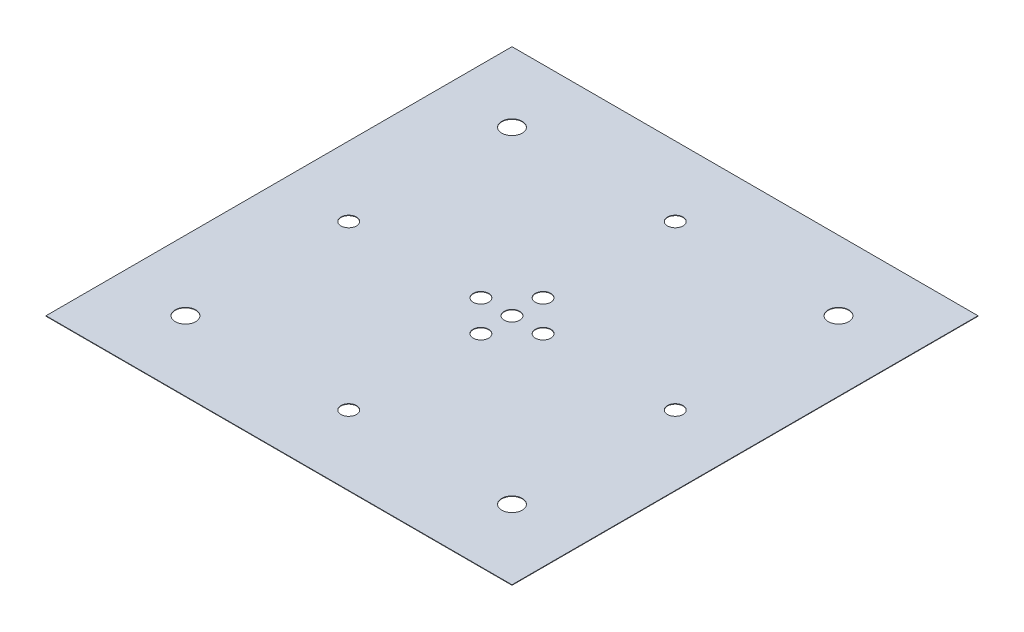
ISO-10303-21;
HEADER;
FILE_DESCRIPTION(('STEP AP214'),'2;1');
FILE_NAME('part.step','',(''),(''),'','','');
FILE_SCHEMA(('AUTOMOTIVE_DESIGN { 1 0 10303 214 1 1 1 1 }'));
ENDSEC;
DATA;
#1=APPLICATION_CONTEXT('core data for automotive mechanical design processes');
#2=APPLICATION_PROTOCOL_DEFINITION('international standard','automotive_design',2000,#1);
#3=PRODUCT_CONTEXT('',#1,'mechanical');
#4=PRODUCT('Part','Part','',(#3));
#5=PRODUCT_RELATED_PRODUCT_CATEGORY('part','',(#4));
#6=PRODUCT_DEFINITION_FORMATION('','',#4);
#7=PRODUCT_DEFINITION_CONTEXT('part definition',#1,'design');
#8=PRODUCT_DEFINITION('design','',#6,#7);
#9=PRODUCT_DEFINITION_SHAPE('','',#8);
#10=(LENGTH_UNIT() NAMED_UNIT(*) SI_UNIT(.MILLI.,.METRE.));
#11=(NAMED_UNIT(*) PLANE_ANGLE_UNIT() SI_UNIT($,.RADIAN.));
#12=(NAMED_UNIT(*) SI_UNIT($,.STERADIAN.) SOLID_ANGLE_UNIT());
#13=UNCERTAINTY_MEASURE_WITH_UNIT(LENGTH_MEASURE(1.E-05),#10,'distance_accuracy_value','');
#14=(GEOMETRIC_REPRESENTATION_CONTEXT(3) GLOBAL_UNCERTAINTY_ASSIGNED_CONTEXT((#13)) GLOBAL_UNIT_ASSIGNED_CONTEXT((#10,
#11,#12)) REPRESENTATION_CONTEXT('',''));
#15=CARTESIAN_POINT('',(0.,0.,0.));
#16=DIRECTION('',(0.,0.,1.));
#17=DIRECTION('',(1.,0.,0.));
#18=AXIS2_PLACEMENT_3D('',#15,#16,#17);
#19=CARTESIAN_POINT('',(-1495.5,-1494.,2994.));
#20=DIRECTION('',(0.,1.,0.));
#21=DIRECTION('',(0.,0.,1.));
#22=AXIS2_PLACEMENT_3D('',#19,#20,#21);
#23=PLANE('',#22);
#24=DIRECTION('',(-1.,0.,0.));
#25=VECTOR('',#24,1.);
#26=CARTESIAN_POINT('',(0.,-1494.,2997.));
#27=LINE('',#26,#25);
#28=CARTESIAN_POINT('',(1498.5,-1494.,2997.));
#29=VERTEX_POINT('',#28);
#30=CARTESIAN_POINT('',(-1498.5,-1494.,2997.));
#31=VERTEX_POINT('',#30);
#32=EDGE_CURVE('E77',#29,#31,#27,.T.);
#33=ORIENTED_EDGE('',*,*,#32,.F.);
#34=DIRECTION('',(0.,0.,-1.));
#35=VECTOR('',#34,1.);
#36=CARTESIAN_POINT('',(1498.5,-1494.,2997.));
#37=LINE('',#36,#35);
#38=CARTESIAN_POINT('',(1498.5,-1494.,0.));
#39=VERTEX_POINT('',#38);
#40=EDGE_CURVE('E89',#29,#39,#37,.T.);
#41=ORIENTED_EDGE('',*,*,#40,.T.);
#42=DIRECTION('',(-1.,0.,0.));
#43=VECTOR('',#42,1.);
#44=CARTESIAN_POINT('',(0.,-1494.,0.));
#45=LINE('',#44,#43);
#46=CARTESIAN_POINT('',(-1498.5,-1494.,0.));
#47=VERTEX_POINT('',#46);
#48=EDGE_CURVE('E98',#39,#47,#45,.T.);
#49=ORIENTED_EDGE('',*,*,#48,.T.);
#50=DIRECTION('',(0.,0.,1.));
#51=VECTOR('',#50,1.);
#52=CARTESIAN_POINT('',(-1498.5,-1494.,2997.));
#53=LINE('',#52,#51);
#54=EDGE_CURVE('E99',#47,#31,#53,.T.);
#55=ORIENTED_EDGE('',*,*,#54,.T.);
#56=EDGE_LOOP('',(#33,#41,#49,#55));
#57=FACE_BOUND('',#56,.T.);
#58=CARTESIAN_POINT('',(-3.71924713249427E-12,-1494.,1698.5));
#59=DIRECTION('',(0.,1.,0.));
#60=DIRECTION('',(0.,0.,1.));
#61=AXIS2_PLACEMENT_3D('',#58,#59,#60);
#62=CIRCLE('',#61,49.8499999999994);
#63=CARTESIAN_POINT('',(-3.71924713249427E-12,-1494.,1748.35));
#64=VERTEX_POINT('',#63);
#65=EDGE_CURVE('E95',#64,#64,#62,.T.);
#66=ORIENTED_EDGE('',*,*,#65,.F.);
#67=EDGE_LOOP('',(#66));
#68=FACE_BOUND('',#67,.T.);
#69=CARTESIAN_POINT('',(2.22044604925031E-13,-1494.,2548.5));
#70=DIRECTION('',(0.,1.,0.));
#71=DIRECTION('',(0.,0.,1.));
#72=AXIS2_PLACEMENT_3D('',#69,#70,#71);
#73=CIRCLE('',#72,49.8499999999999);
#74=CARTESIAN_POINT('',(2.22044604925031E-13,-1494.,2598.35));
#75=VERTEX_POINT('',#74);
#76=EDGE_CURVE('E117',#75,#75,#73,.T.);
#77=ORIENTED_EDGE('',*,*,#76,.F.);
#78=EDGE_LOOP('',(#77));
#79=FACE_BOUND('',#78,.T.);
#80=CARTESIAN_POINT('',(1049.99999999999,-1494.,448.500000000012));
#81=DIRECTION('',(0.,1.,0.));
#82=DIRECTION('',(0.,0.,1.));
#83=AXIS2_PLACEMENT_3D('',#80,#81,#82);
#84=CIRCLE('',#83,65.8000000000001);
#85=CARTESIAN_POINT('',(1049.99999999999,-1494.,514.300000000012));
#86=VERTEX_POINT('',#85);
#87=EDGE_CURVE('E120',#86,#86,#84,.T.);
#88=ORIENTED_EDGE('',*,*,#87,.F.);
#89=EDGE_LOOP('',(#88));
#90=FACE_BOUND('',#89,.T.);
#91=CARTESIAN_POINT('',(1050.,-1494.,1498.50000000001));
#92=DIRECTION('',(0.,1.,0.));
#93=DIRECTION('',(0.,0.,1.));
#94=AXIS2_PLACEMENT_3D('',#91,#92,#93);
#95=CIRCLE('',#94,49.85);
#96=CARTESIAN_POINT('',(1050.,-1494.,1548.35000000001));
#97=VERTEX_POINT('',#96);
#98=EDGE_CURVE('E123',#97,#97,#95,.T.);
#99=ORIENTED_EDGE('',*,*,#98,.F.);
#100=EDGE_LOOP('',(#99));
#101=FACE_BOUND('',#100,.T.);
#102=CARTESIAN_POINT('',(-1049.99999999999,-1494.,448.500000000007));
#103=DIRECTION('',(0.,1.,0.));
#104=DIRECTION('',(0.,0.,1.));
#105=AXIS2_PLACEMENT_3D('',#102,#103,#104);
#106=CIRCLE('',#105,65.8000000000016);
#107=CARTESIAN_POINT('',(-1049.99999999999,-1494.,514.300000000009));
#108=VERTEX_POINT('',#107);
#109=EDGE_CURVE('E126',#108,#108,#106,.T.);
#110=ORIENTED_EDGE('',*,*,#109,.F.);
#111=EDGE_LOOP('',(#110));
#112=FACE_BOUND('',#111,.T.);
#113=CARTESIAN_POINT('',(-200.,-1494.,1498.5));
#114=DIRECTION('',(0.,1.,0.));
#115=DIRECTION('',(0.,0.,1.));
#116=AXIS2_PLACEMENT_3D('',#113,#114,#115);
#117=CIRCLE('',#116,49.85);
#118=CARTESIAN_POINT('',(-200.,-1494.,1548.35));
#119=VERTEX_POINT('',#118);
#120=EDGE_CURVE('E129',#119,#119,#117,.T.);
#121=ORIENTED_EDGE('',*,*,#120,.F.);
#122=EDGE_LOOP('',(#121));
#123=FACE_BOUND('',#122,.T.);
#124=CARTESIAN_POINT('',(-1050.,-1494.,1498.50000000001));
#125=DIRECTION('',(0.,1.,0.));
#126=DIRECTION('',(0.,0.,1.));
#127=AXIS2_PLACEMENT_3D('',#124,#125,#126);
#128=CIRCLE('',#127,49.85);
#129=CARTESIAN_POINT('',(-1050.,-1494.,1548.35000000001));
#130=VERTEX_POINT('',#129);
#131=EDGE_CURVE('E132',#130,#130,#128,.T.);
#132=ORIENTED_EDGE('',*,*,#131,.F.);
#133=EDGE_LOOP('',(#132));
#134=FACE_BOUND('',#133,.T.);
#135=CARTESIAN_POINT('',(200.,-1494.,1498.5));
#136=DIRECTION('',(0.,1.,0.));
#137=DIRECTION('',(0.,0.,1.));
#138=AXIS2_PLACEMENT_3D('',#135,#136,#137);
#139=CIRCLE('',#138,49.85);
#140=CARTESIAN_POINT('',(200.,-1494.,1548.35));
#141=VERTEX_POINT('',#140);
#142=EDGE_CURVE('E135',#141,#141,#139,.T.);
#143=ORIENTED_EDGE('',*,*,#142,.F.);
#144=EDGE_LOOP('',(#143));
#145=FACE_BOUND('',#144,.T.);
#146=CARTESIAN_POINT('',(-2.4980018054066E-12,-1494.,1298.5));
#147=DIRECTION('',(0.,1.,0.));
#148=DIRECTION('',(0.,0.,1.));
#149=AXIS2_PLACEMENT_3D('',#146,#147,#148);
#150=CIRCLE('',#149,49.85);
#151=CARTESIAN_POINT('',(-2.4980018054066E-12,-1494.,1348.35));
#152=VERTEX_POINT('',#151);
#153=EDGE_CURVE('E138',#152,#152,#150,.T.);
#154=ORIENTED_EDGE('',*,*,#153,.F.);
#155=EDGE_LOOP('',(#154));
#156=FACE_BOUND('',#155,.T.);
#157=CARTESIAN_POINT('',(5.77315972805081E-12,-1494.,448.500000000004));
#158=DIRECTION('',(0.,1.,0.));
#159=DIRECTION('',(0.,0.,1.));
#160=AXIS2_PLACEMENT_3D('',#157,#158,#159);
#161=CIRCLE('',#160,49.8500000000002);
#162=CARTESIAN_POINT('',(5.77315972805081E-12,-1494.,498.350000000004));
#163=VERTEX_POINT('',#162);
#164=EDGE_CURVE('E141',#163,#163,#161,.T.);
#165=ORIENTED_EDGE('',*,*,#164,.F.);
#166=EDGE_LOOP('',(#165));
#167=FACE_BOUND('',#166,.T.);
#168=CARTESIAN_POINT('',(1049.99999999999,-1494.,2548.49999999999));
#169=DIRECTION('',(0.,1.,0.));
#170=DIRECTION('',(0.,0.,1.));
#171=AXIS2_PLACEMENT_3D('',#168,#169,#170);
#172=CIRCLE('',#171,65.8000000000139);
#173=CARTESIAN_POINT('',(1049.99999999999,-1494.,2614.30000000001));
#174=VERTEX_POINT('',#173);
#175=EDGE_CURVE('E144',#174,#174,#172,.T.);
#176=ORIENTED_EDGE('',*,*,#175,.F.);
#177=EDGE_LOOP('',(#176));
#178=FACE_BOUND('',#177,.T.);
#179=CARTESIAN_POINT('',(-1049.99999999999,-1494.,2548.49999999999));
#180=DIRECTION('',(0.,1.,0.));
#181=DIRECTION('',(0.,0.,1.));
#182=AXIS2_PLACEMENT_3D('',#179,#180,#181);
#183=CIRCLE('',#182,65.800000000014);
#184=CARTESIAN_POINT('',(-1049.99999999999,-1494.,2614.30000000001));
#185=VERTEX_POINT('',#184);
#186=EDGE_CURVE('E147',#185,#185,#183,.T.);
#187=ORIENTED_EDGE('',*,*,#186,.F.);
#188=EDGE_LOOP('',(#187));
#189=FACE_BOUND('',#188,.T.);
#190=CARTESIAN_POINT('',(1.83513322852231E-13,-1494.,1498.5));
#191=DIRECTION('',(0.,1.,0.));
#192=DIRECTION('',(0.,0.,1.));
#193=AXIS2_PLACEMENT_3D('',#190,#191,#192);
#194=CIRCLE('',#193,49.8499999999998);
#195=CARTESIAN_POINT('',(1.83513322852231E-13,-1494.,1548.35));
#196=VERTEX_POINT('',#195);
#197=EDGE_CURVE('E150',#196,#196,#194,.T.);
#198=ORIENTED_EDGE('',*,*,#197,.F.);
#199=EDGE_LOOP('',(#198));
#200=FACE_BOUND('',#199,.T.);
#201=ADVANCED_FACE('F38',(#57,#68,#79,#90,#101,#112,#123,#134,#145,#156,#167,#178,#189,#200),
#23,.T.);
#202=CARTESIAN_POINT('',(-1498.5,1497.,2997.));
#203=DIRECTION('',(1.,0.,0.));
#204=DIRECTION('',(0.,1.,0.));
#205=AXIS2_PLACEMENT_3D('',#202,#203,#204);
#206=PLANE('',#205);
#207=ORIENTED_EDGE('',*,*,#54,.F.);
#208=DIRECTION('',(0.,-1.,0.));
#209=VECTOR('',#208,1.);
#210=CARTESIAN_POINT('',(-1498.5,1497.,0.));
#211=LINE('',#210,#209);
#212=CARTESIAN_POINT('',(-1498.5,-1497.,0.));
#213=VERTEX_POINT('',#212);
#214=EDGE_CURVE('E57',#47,#213,#211,.T.);
#215=ORIENTED_EDGE('',*,*,#214,.T.);
#216=DIRECTION('',(0.,0.,-1.));
#217=VECTOR('',#216,1.);
#218=CARTESIAN_POINT('',(-1498.5,-1497.,2997.));
#219=LINE('',#218,#217);
#220=CARTESIAN_POINT('',(-1498.5,-1497.,2997.));
#221=VERTEX_POINT('',#220);
#222=EDGE_CURVE('E188',#221,#213,#219,.T.);
#223=ORIENTED_EDGE('',*,*,#222,.F.);
#224=DIRECTION('',(0.,-1.,0.));
#225=VECTOR('',#224,1.);
#226=CARTESIAN_POINT('',(-1498.5,1497.,2997.));
#227=LINE('',#226,#225);
#228=EDGE_CURVE('E105',#31,#221,#227,.T.);
#229=ORIENTED_EDGE('',*,*,#228,.F.);
#230=EDGE_LOOP('',(#207,#215,#223,#229));
#231=FACE_BOUND('',#230,.T.);
#232=ADVANCED_FACE('F191',(#231),#206,.F.);
#233=CARTESIAN_POINT('',(-1498.5,-1497.,2997.));
#234=DIRECTION('',(0.,1.,0.));
#235=DIRECTION('',(0.,0.,1.));
#236=AXIS2_PLACEMENT_3D('',#233,#234,#235);
#237=PLANE('',#236);
#238=CARTESIAN_POINT('',(-3.71924713249427E-12,-1497.,1698.5));
#239=DIRECTION('',(0.,1.,0.));
#240=DIRECTION('',(0.,0.,1.));
#241=AXIS2_PLACEMENT_3D('',#238,#239,#240);
#242=CIRCLE('',#241,49.8499999999994);
#243=CARTESIAN_POINT('',(-3.71924713249427E-12,-1497.,1748.35));
#244=VERTEX_POINT('',#243);
#245=EDGE_CURVE('E169',#244,#244,#242,.T.);
#246=ORIENTED_EDGE('',*,*,#245,.T.);
#247=EDGE_LOOP('',(#246));
#248=FACE_BOUND('',#247,.T.);
#249=CARTESIAN_POINT('',(2.22044604925031E-13,-1497.,2548.5));
#250=DIRECTION('',(0.,1.,0.));
#251=DIRECTION('',(0.,0.,1.));
#252=AXIS2_PLACEMENT_3D('',#249,#250,#251);
#253=CIRCLE('',#252,49.8499999999999);
#254=CARTESIAN_POINT('',(2.22044604925031E-13,-1497.,2598.35));
#255=VERTEX_POINT('',#254);
#256=EDGE_CURVE('E173',#255,#255,#253,.T.);
#257=ORIENTED_EDGE('',*,*,#256,.T.);
#258=EDGE_LOOP('',(#257));
#259=FACE_BOUND('',#258,.T.);
#260=CARTESIAN_POINT('',(1049.99999999999,-1497.,448.500000000012));
#261=DIRECTION('',(0.,1.,0.));
#262=DIRECTION('',(0.,0.,-1.));
#263=AXIS2_PLACEMENT_3D('',#260,#261,#262);
#264=CIRCLE('',#263,65.8000000000001);
#265=CARTESIAN_POINT('',(1049.99999999999,-1497.,382.700000000012));
#266=VERTEX_POINT('',#265);
#267=EDGE_CURVE('E176',#266,#266,#264,.T.);
#268=ORIENTED_EDGE('',*,*,#267,.T.);
#269=EDGE_LOOP('',(#268));
#270=FACE_BOUND('',#269,.T.);
#271=CARTESIAN_POINT('',(1050.,-1497.,1498.50000000001));
#272=DIRECTION('',(0.,1.,0.));
#273=DIRECTION('',(0.,0.,-1.));
#274=AXIS2_PLACEMENT_3D('',#271,#272,#273);
#275=CIRCLE('',#274,49.85);
#276=CARTESIAN_POINT('',(1050.,-1497.,1448.65000000001));
#277=VERTEX_POINT('',#276);
#278=EDGE_CURVE('E166',#277,#277,#275,.T.);
#279=ORIENTED_EDGE('',*,*,#278,.T.);
#280=EDGE_LOOP('',(#279));
#281=FACE_BOUND('',#280,.T.);
#282=CARTESIAN_POINT('',(-1049.99999999999,-1497.,448.500000000007));
#283=DIRECTION('',(0.,1.,0.));
#284=DIRECTION('',(0.,0.,1.));
#285=AXIS2_PLACEMENT_3D('',#282,#283,#284);
#286=CIRCLE('',#285,65.8000000000016);
#287=CARTESIAN_POINT('',(-1049.99999999999,-1497.,514.300000000009));
#288=VERTEX_POINT('',#287);
#289=EDGE_CURVE('E156',#288,#288,#286,.T.);
#290=ORIENTED_EDGE('',*,*,#289,.T.);
#291=EDGE_LOOP('',(#290));
#292=FACE_BOUND('',#291,.T.);
#293=CARTESIAN_POINT('',(-200.,-1497.,1498.5));
#294=DIRECTION('',(0.,1.,0.));
#295=DIRECTION('',(0.,0.,1.));
#296=AXIS2_PLACEMENT_3D('',#293,#294,#295);
#297=CIRCLE('',#296,49.85);
#298=CARTESIAN_POINT('',(-200.,-1497.,1548.35));
#299=VERTEX_POINT('',#298);
#300=EDGE_CURVE('E157',#299,#299,#297,.T.);
#301=ORIENTED_EDGE('',*,*,#300,.T.);
#302=EDGE_LOOP('',(#301));
#303=FACE_BOUND('',#302,.T.);
#304=CARTESIAN_POINT('',(-1050.,-1497.,1498.50000000001));
#305=DIRECTION('',(0.,1.,0.));
#306=DIRECTION('',(0.,0.,1.));
#307=AXIS2_PLACEMENT_3D('',#304,#305,#306);
#308=CIRCLE('',#307,49.85);
#309=CARTESIAN_POINT('',(-1050.,-1497.,1548.35000000001));
#310=VERTEX_POINT('',#309);
#311=EDGE_CURVE('E160',#310,#310,#308,.T.);
#312=ORIENTED_EDGE('',*,*,#311,.T.);
#313=EDGE_LOOP('',(#312));
#314=FACE_BOUND('',#313,.T.);
#315=CARTESIAN_POINT('',(200.,-1497.,1498.5));
#316=DIRECTION('',(0.,1.,0.));
#317=DIRECTION('',(0.,0.,-1.));
#318=AXIS2_PLACEMENT_3D('',#315,#316,#317);
#319=CIRCLE('',#318,49.85);
#320=CARTESIAN_POINT('',(200.,-1497.,1448.65));
#321=VERTEX_POINT('',#320);
#322=EDGE_CURVE('E163',#321,#321,#319,.T.);
#323=ORIENTED_EDGE('',*,*,#322,.T.);
#324=EDGE_LOOP('',(#323));
#325=FACE_BOUND('',#324,.T.);
#326=CARTESIAN_POINT('',(-2.4980018054066E-12,-1497.,1298.5));
#327=DIRECTION('',(0.,1.,0.));
#328=DIRECTION('',(0.,0.,-1.));
#329=AXIS2_PLACEMENT_3D('',#326,#327,#328);
#330=CIRCLE('',#329,49.85);
#331=CARTESIAN_POINT('',(-2.4980018054066E-12,-1497.,1248.65));
#332=VERTEX_POINT('',#331);
#333=EDGE_CURVE('E172',#332,#332,#330,.T.);
#334=ORIENTED_EDGE('',*,*,#333,.T.);
#335=EDGE_LOOP('',(#334));
#336=FACE_BOUND('',#335,.T.);
#337=CARTESIAN_POINT('',(5.77315972805081E-12,-1497.,448.500000000004));
#338=DIRECTION('',(0.,1.,0.));
#339=DIRECTION('',(0.,0.,-1.));
#340=AXIS2_PLACEMENT_3D('',#337,#338,#339);
#341=CIRCLE('',#340,49.8500000000002);
#342=CARTESIAN_POINT('',(5.77315972805081E-12,-1497.,398.650000000004));
#343=VERTEX_POINT('',#342);
#344=EDGE_CURVE('E183',#343,#343,#341,.T.);
#345=ORIENTED_EDGE('',*,*,#344,.T.);
#346=EDGE_LOOP('',(#345));
#347=FACE_BOUND('',#346,.T.);
#348=CARTESIAN_POINT('',(1049.99999999999,-1497.,2548.49999999999));
#349=DIRECTION('',(0.,1.,0.));
#350=DIRECTION('',(0.,0.,1.));
#351=AXIS2_PLACEMENT_3D('',#348,#349,#350);
#352=CIRCLE('',#351,65.8000000000139);
#353=CARTESIAN_POINT('',(1049.99999999999,-1497.,2614.30000000001));
#354=VERTEX_POINT('',#353);
#355=EDGE_CURVE('E48',#354,#354,#352,.T.);
#356=ORIENTED_EDGE('',*,*,#355,.T.);
#357=EDGE_LOOP('',(#356));
#358=FACE_BOUND('',#357,.T.);
#359=CARTESIAN_POINT('',(-1049.99999999999,-1497.,2548.49999999999));
#360=DIRECTION('',(0.,1.,0.));
#361=DIRECTION('',(0.,0.,-1.));
#362=AXIS2_PLACEMENT_3D('',#359,#360,#361);
#363=CIRCLE('',#362,65.800000000014);
#364=CARTESIAN_POINT('',(-1049.99999999999,-1497.,2482.69999999998));
#365=VERTEX_POINT('',#364);
#366=EDGE_CURVE('E11',#365,#365,#363,.T.);
#367=ORIENTED_EDGE('',*,*,#366,.T.);
#368=EDGE_LOOP('',(#367));
#369=FACE_BOUND('',#368,.T.);
#370=CARTESIAN_POINT('',(1.83513322852231E-13,-1497.,1498.5));
#371=DIRECTION('',(0.,1.,0.));
#372=DIRECTION('',(0.,0.,1.));
#373=AXIS2_PLACEMENT_3D('',#370,#371,#372);
#374=CIRCLE('',#373,49.8499999999998);
#375=CARTESIAN_POINT('',(1.83513322852231E-13,-1497.,1548.35));
#376=VERTEX_POINT('',#375);
#377=EDGE_CURVE('E153',#376,#376,#374,.T.);
#378=ORIENTED_EDGE('',*,*,#377,.T.);
#379=EDGE_LOOP('',(#378));
#380=FACE_BOUND('',#379,.T.);
#381=ORIENTED_EDGE('',*,*,#222,.T.);
#382=DIRECTION('',(1.,0.,0.));
#383=VECTOR('',#382,1.);
#384=CARTESIAN_POINT('',(-1498.5,-1497.,0.));
#385=LINE('',#384,#383);
#386=CARTESIAN_POINT('',(1498.5,-1497.,0.));
#387=VERTEX_POINT('',#386);
#388=EDGE_CURVE('E108',#213,#387,#385,.T.);
#389=ORIENTED_EDGE('',*,*,#388,.T.);
#390=DIRECTION('',(0.,0.,-1.));
#391=VECTOR('',#390,1.);
#392=CARTESIAN_POINT('',(1498.5,-1497.,2997.));
#393=LINE('',#392,#391);
#394=CARTESIAN_POINT('',(1498.5,-1497.,2997.));
#395=VERTEX_POINT('',#394);
#396=EDGE_CURVE('E90',#395,#387,#393,.T.);
#397=ORIENTED_EDGE('',*,*,#396,.F.);
#398=DIRECTION('',(1.,0.,0.));
#399=VECTOR('',#398,1.);
#400=CARTESIAN_POINT('',(-1498.5,-1497.,2997.));
#401=LINE('',#400,#399);
#402=EDGE_CURVE('E69',#221,#395,#401,.T.);
#403=ORIENTED_EDGE('',*,*,#402,.F.);
#404=EDGE_LOOP('',(#381,#389,#397,#403));
#405=FACE_BOUND('',#404,.T.);
#406=ADVANCED_FACE('F189',(#248,#259,#270,#281,#292,#303,#314,#325,#336,#347,#358,#369,#380,
#405),#237,.F.);
#407=CARTESIAN_POINT('',(-3.71924713249427E-12,-1497.,1698.5));
#408=DIRECTION('',(0.,1.,0.));
#409=DIRECTION('',(0.,0.,1.));
#410=AXIS2_PLACEMENT_3D('',#407,#408,#409);
#411=CYLINDRICAL_SURFACE('',#410,49.8499999999994);
#412=ORIENTED_EDGE('',*,*,#65,.T.);
#413=EDGE_LOOP('',(#412));
#414=FACE_BOUND('',#413,.T.);
#415=ORIENTED_EDGE('',*,*,#245,.F.);
#416=EDGE_LOOP('',(#415));
#417=FACE_BOUND('',#416,.T.);
#418=ADVANCED_FACE('F40',(#414,#417),#411,.F.);
#419=CARTESIAN_POINT('',(2.22044604925031E-13,-1497.,2548.5));
#420=DIRECTION('',(0.,1.,0.));
#421=DIRECTION('',(0.,0.,1.));
#422=AXIS2_PLACEMENT_3D('',#419,#420,#421);
#423=CYLINDRICAL_SURFACE('',#422,49.8499999999999);
#424=ORIENTED_EDGE('',*,*,#76,.T.);
#425=EDGE_LOOP('',(#424));
#426=FACE_BOUND('',#425,.T.);
#427=ORIENTED_EDGE('',*,*,#256,.F.);
#428=EDGE_LOOP('',(#427));
#429=FACE_BOUND('',#428,.T.);
#430=ADVANCED_FACE('F258',(#426,#429),#423,.F.);
#431=CARTESIAN_POINT('',(1049.99999999999,-1497.,448.500000000012));
#432=DIRECTION('',(0.,1.,0.));
#433=DIRECTION('',(0.,0.,1.));
#434=AXIS2_PLACEMENT_3D('',#431,#432,#433);
#435=CYLINDRICAL_SURFACE('',#434,65.8000000000001);
#436=ORIENTED_EDGE('',*,*,#87,.T.);
#437=EDGE_LOOP('',(#436));
#438=FACE_BOUND('',#437,.T.);
#439=ORIENTED_EDGE('',*,*,#267,.F.);
#440=EDGE_LOOP('',(#439));
#441=FACE_BOUND('',#440,.T.);
#442=ADVANCED_FACE('F255',(#438,#441),#435,.F.);
#443=CARTESIAN_POINT('',(1050.,-1497.,1498.50000000001));
#444=DIRECTION('',(0.,1.,0.));
#445=DIRECTION('',(0.,0.,1.));
#446=AXIS2_PLACEMENT_3D('',#443,#444,#445);
#447=CYLINDRICAL_SURFACE('',#446,49.85);
#448=ORIENTED_EDGE('',*,*,#98,.T.);
#449=EDGE_LOOP('',(#448));
#450=FACE_BOUND('',#449,.T.);
#451=ORIENTED_EDGE('',*,*,#278,.F.);
#452=EDGE_LOOP('',(#451));
#453=FACE_BOUND('',#452,.T.);
#454=ADVANCED_FACE('F251',(#450,#453),#447,.F.);
#455=CARTESIAN_POINT('',(-1049.99999999999,-1497.,448.500000000007));
#456=DIRECTION('',(0.,1.,0.));
#457=DIRECTION('',(0.,0.,1.));
#458=AXIS2_PLACEMENT_3D('',#455,#456,#457);
#459=CYLINDRICAL_SURFACE('',#458,65.8000000000016);
#460=ORIENTED_EDGE('',*,*,#109,.T.);
#461=EDGE_LOOP('',(#460));
#462=FACE_BOUND('',#461,.T.);
#463=ORIENTED_EDGE('',*,*,#289,.F.);
#464=EDGE_LOOP('',(#463));
#465=FACE_BOUND('',#464,.T.);
#466=ADVANCED_FACE('F247',(#462,#465),#459,.F.);
#467=CARTESIAN_POINT('',(-200.,-1497.,1498.5));
#468=DIRECTION('',(0.,1.,0.));
#469=DIRECTION('',(0.,0.,1.));
#470=AXIS2_PLACEMENT_3D('',#467,#468,#469);
#471=CYLINDRICAL_SURFACE('',#470,49.85);
#472=ORIENTED_EDGE('',*,*,#120,.T.);
#473=EDGE_LOOP('',(#472));
#474=FACE_BOUND('',#473,.T.);
#475=ORIENTED_EDGE('',*,*,#300,.F.);
#476=EDGE_LOOP('',(#475));
#477=FACE_BOUND('',#476,.T.);
#478=ADVANCED_FACE('F243',(#474,#477),#471,.F.);
#479=CARTESIAN_POINT('',(-1050.,-1497.,1498.50000000001));
#480=DIRECTION('',(0.,1.,0.));
#481=DIRECTION('',(0.,0.,1.));
#482=AXIS2_PLACEMENT_3D('',#479,#480,#481);
#483=CYLINDRICAL_SURFACE('',#482,49.85);
#484=ORIENTED_EDGE('',*,*,#131,.T.);
#485=EDGE_LOOP('',(#484));
#486=FACE_BOUND('',#485,.T.);
#487=ORIENTED_EDGE('',*,*,#311,.F.);
#488=EDGE_LOOP('',(#487));
#489=FACE_BOUND('',#488,.T.);
#490=ADVANCED_FACE('F239',(#486,#489),#483,.F.);
#491=CARTESIAN_POINT('',(200.,-1497.,1498.5));
#492=DIRECTION('',(0.,1.,0.));
#493=DIRECTION('',(0.,0.,1.));
#494=AXIS2_PLACEMENT_3D('',#491,#492,#493);
#495=CYLINDRICAL_SURFACE('',#494,49.85);
#496=ORIENTED_EDGE('',*,*,#142,.T.);
#497=EDGE_LOOP('',(#496));
#498=FACE_BOUND('',#497,.T.);
#499=ORIENTED_EDGE('',*,*,#322,.F.);
#500=EDGE_LOOP('',(#499));
#501=FACE_BOUND('',#500,.T.);
#502=ADVANCED_FACE('F235',(#498,#501),#495,.F.);
#503=CARTESIAN_POINT('',(-2.4980018054066E-12,-1497.,1298.5));
#504=DIRECTION('',(0.,1.,0.));
#505=DIRECTION('',(0.,0.,1.));
#506=AXIS2_PLACEMENT_3D('',#503,#504,#505);
#507=CYLINDRICAL_SURFACE('',#506,49.85);
#508=ORIENTED_EDGE('',*,*,#153,.T.);
#509=EDGE_LOOP('',(#508));
#510=FACE_BOUND('',#509,.T.);
#511=ORIENTED_EDGE('',*,*,#333,.F.);
#512=EDGE_LOOP('',(#511));
#513=FACE_BOUND('',#512,.T.);
#514=ADVANCED_FACE('F231',(#510,#513),#507,.F.);
#515=CARTESIAN_POINT('',(5.77315972805081E-12,-1497.,448.500000000004));
#516=DIRECTION('',(0.,1.,0.));
#517=DIRECTION('',(0.,0.,1.));
#518=AXIS2_PLACEMENT_3D('',#515,#516,#517);
#519=CYLINDRICAL_SURFACE('',#518,49.8500000000002);
#520=ORIENTED_EDGE('',*,*,#164,.T.);
#521=EDGE_LOOP('',(#520));
#522=FACE_BOUND('',#521,.T.);
#523=ORIENTED_EDGE('',*,*,#344,.F.);
#524=EDGE_LOOP('',(#523));
#525=FACE_BOUND('',#524,.T.);
#526=ADVANCED_FACE('F227',(#522,#525),#519,.F.);
#527=CARTESIAN_POINT('',(1049.99999999999,-1497.,2548.49999999999));
#528=DIRECTION('',(0.,1.,0.));
#529=DIRECTION('',(0.,0.,1.));
#530=AXIS2_PLACEMENT_3D('',#527,#528,#529);
#531=CYLINDRICAL_SURFACE('',#530,65.8000000000139);
#532=ORIENTED_EDGE('',*,*,#175,.T.);
#533=EDGE_LOOP('',(#532));
#534=FACE_BOUND('',#533,.T.);
#535=ORIENTED_EDGE('',*,*,#355,.F.);
#536=EDGE_LOOP('',(#535));
#537=FACE_BOUND('',#536,.T.);
#538=ADVANCED_FACE('F220',(#534,#537),#531,.F.);
#539=CARTESIAN_POINT('',(-1049.99999999999,-1497.,2548.49999999999));
#540=DIRECTION('',(0.,1.,0.));
#541=DIRECTION('',(0.,0.,1.));
#542=AXIS2_PLACEMENT_3D('',#539,#540,#541);
#543=CYLINDRICAL_SURFACE('',#542,65.800000000014);
#544=ORIENTED_EDGE('',*,*,#186,.T.);
#545=EDGE_LOOP('',(#544));
#546=FACE_BOUND('',#545,.T.);
#547=ORIENTED_EDGE('',*,*,#366,.F.);
#548=EDGE_LOOP('',(#547));
#549=FACE_BOUND('',#548,.T.);
#550=ADVANCED_FACE('F214',(#546,#549),#543,.F.);
#551=CARTESIAN_POINT('',(1.83513322852231E-13,-1497.,1498.5));
#552=DIRECTION('',(0.,1.,0.));
#553=DIRECTION('',(0.,0.,1.));
#554=AXIS2_PLACEMENT_3D('',#551,#552,#553);
#555=CYLINDRICAL_SURFACE('',#554,49.8499999999998);
#556=ORIENTED_EDGE('',*,*,#197,.T.);
#557=EDGE_LOOP('',(#556));
#558=FACE_BOUND('',#557,.T.);
#559=ORIENTED_EDGE('',*,*,#377,.F.);
#560=EDGE_LOOP('',(#559));
#561=FACE_BOUND('',#560,.T.);
#562=ADVANCED_FACE('F210',(#558,#561),#555,.F.);
#563=CARTESIAN_POINT('',(1498.5,1497.,2997.));
#564=DIRECTION('',(-1.,0.,0.));
#565=DIRECTION('',(0.,-1.,0.));
#566=AXIS2_PLACEMENT_3D('',#563,#564,#565);
#567=PLANE('',#566);
#568=ORIENTED_EDGE('',*,*,#40,.F.);
#569=DIRECTION('',(0.,1.,0.));
#570=VECTOR('',#569,1.);
#571=CARTESIAN_POINT('',(1498.5,1497.,2997.));
#572=LINE('',#571,#570);
#573=EDGE_CURVE('E107',#395,#29,#572,.T.);
#574=ORIENTED_EDGE('',*,*,#573,.F.);
#575=ORIENTED_EDGE('',*,*,#396,.T.);
#576=DIRECTION('',(0.,1.,0.));
#577=VECTOR('',#576,1.);
#578=CARTESIAN_POINT('',(1498.5,1497.,0.));
#579=LINE('',#578,#577);
#580=EDGE_CURVE('E42',#387,#39,#579,.T.);
#581=ORIENTED_EDGE('',*,*,#580,.T.);
#582=EDGE_LOOP('',(#568,#574,#575,#581));
#583=FACE_BOUND('',#582,.T.);
#584=ADVANCED_FACE('F87',(#583),#567,.F.);
#585=CARTESIAN_POINT('',(0.,0.,0.));
#586=DIRECTION('',(0.,0.,1.));
#587=DIRECTION('',(1.,0.,0.));
#588=AXIS2_PLACEMENT_3D('',#585,#586,#587);
#589=PLANE('',#588);
#590=ORIENTED_EDGE('',*,*,#48,.F.);
#591=ORIENTED_EDGE('',*,*,#580,.F.);
#592=ORIENTED_EDGE('',*,*,#388,.F.);
#593=ORIENTED_EDGE('',*,*,#214,.F.);
#594=EDGE_LOOP('',(#590,#591,#592,#593));
#595=FACE_BOUND('',#594,.T.);
#596=ADVANCED_FACE('F101',(#595),#589,.F.);
#597=CARTESIAN_POINT('',(0.,0.,2997.));
#598=DIRECTION('',(0.,0.,1.));
#599=DIRECTION('',(1.,0.,0.));
#600=AXIS2_PLACEMENT_3D('',#597,#598,#599);
#601=PLANE('',#600);
#602=ORIENTED_EDGE('',*,*,#573,.T.);
#603=ORIENTED_EDGE('',*,*,#32,.T.);
#604=ORIENTED_EDGE('',*,*,#228,.T.);
#605=ORIENTED_EDGE('',*,*,#402,.T.);
#606=EDGE_LOOP('',(#602,#603,#604,#605));
#607=FACE_BOUND('',#606,.T.);
#608=ADVANCED_FACE('F192',(#607),#601,.T.);
#609=CLOSED_SHELL('',(#201,#232,#406,#418,#430,#442,#454,#466,#478,#490,#502,#514,#526,#538,
#550,#562,#584,#596,#608));
#610=MANIFOLD_SOLID_BREP('B2',#609);
#611=ADVANCED_BREP_SHAPE_REPRESENTATION('',(#18,#610),#14);
#612=SHAPE_DEFINITION_REPRESENTATION(#9,#611);
ENDSEC;
END-ISO-10303-21;
